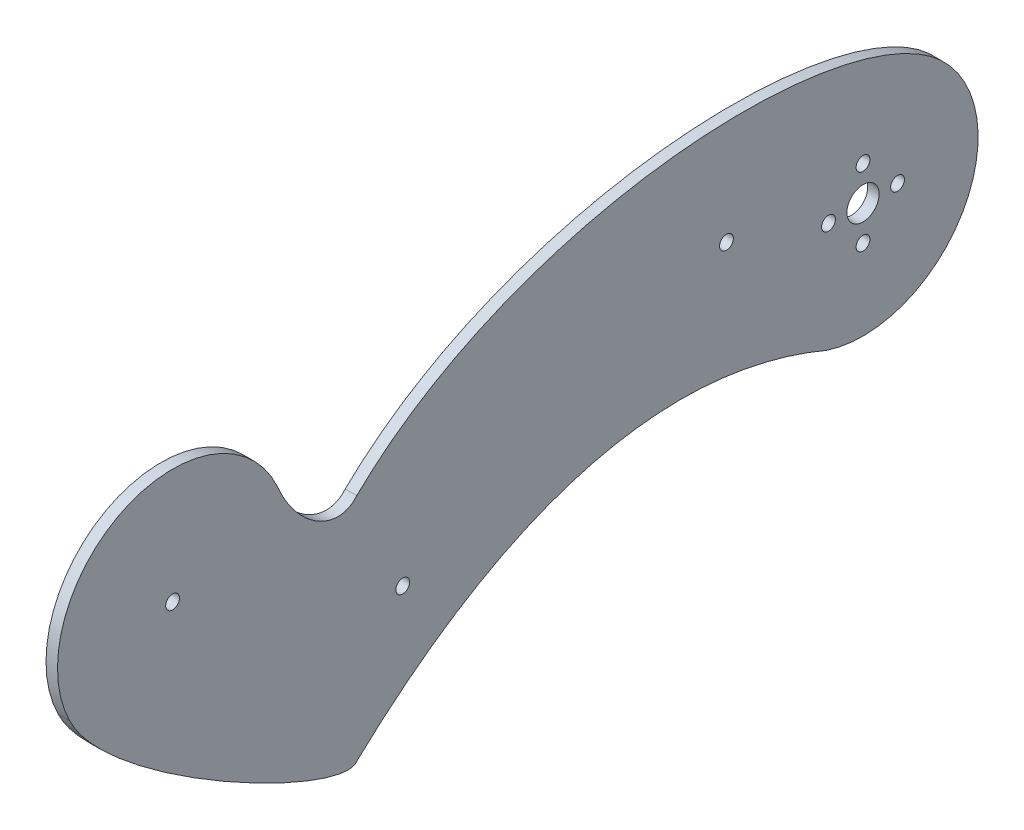
ISO-10303-21;
HEADER;
FILE_DESCRIPTION(('STEP AP214'),'2;1');
FILE_NAME('part.step','',(''),(''),'','','');
FILE_SCHEMA(('AUTOMOTIVE_DESIGN { 1 0 10303 214 1 1 1 1 }'));
ENDSEC;
DATA;
#1=APPLICATION_CONTEXT('core data for automotive mechanical design processes');
#2=APPLICATION_PROTOCOL_DEFINITION('international standard','automotive_design',2000,#1);
#3=PRODUCT_CONTEXT('',#1,'mechanical');
#4=PRODUCT('Part','Part','',(#3));
#5=PRODUCT_RELATED_PRODUCT_CATEGORY('part','',(#4));
#6=PRODUCT_DEFINITION_FORMATION('','',#4);
#7=PRODUCT_DEFINITION_CONTEXT('part definition',#1,'design');
#8=PRODUCT_DEFINITION('design','',#6,#7);
#9=PRODUCT_DEFINITION_SHAPE('','',#8);
#10=(LENGTH_UNIT() NAMED_UNIT(*) SI_UNIT(.MILLI.,.METRE.));
#11=(NAMED_UNIT(*) PLANE_ANGLE_UNIT() SI_UNIT($,.RADIAN.));
#12=(NAMED_UNIT(*) SI_UNIT($,.STERADIAN.) SOLID_ANGLE_UNIT());
#13=UNCERTAINTY_MEASURE_WITH_UNIT(LENGTH_MEASURE(1.E-05),#10,'distance_accuracy_value','');
#14=(GEOMETRIC_REPRESENTATION_CONTEXT(3) GLOBAL_UNCERTAINTY_ASSIGNED_CONTEXT((#13)) GLOBAL_UNIT_ASSIGNED_CONTEXT((#10,
#11,#12)) REPRESENTATION_CONTEXT('',''));
#15=CARTESIAN_POINT('',(0.,0.,0.));
#16=DIRECTION('',(0.,0.,1.));
#17=DIRECTION('',(1.,0.,0.));
#18=AXIS2_PLACEMENT_3D('',#15,#16,#17);
#19=CARTESIAN_POINT('',(2.5,-0.537578350679366,118.512850109838));
#20=DIRECTION('',(1.,0.,0.));
#21=DIRECTION('',(0.,0.,-1.));
#22=AXIS2_PLACEMENT_3D('',#19,#20,#21);
#23=PLANE('',#22);
#24=CARTESIAN_POINT('',(2.5,7.5,0.));
#25=DIRECTION('',(1.,0.,0.));
#26=DIRECTION('',(0.,0.,-1.));
#27=AXIS2_PLACEMENT_3D('',#24,#25,#26);
#28=CIRCLE('',#27,1.5);
#29=CARTESIAN_POINT('',(2.5,7.5,-1.5));
#30=VERTEX_POINT('',#29);
#31=EDGE_CURVE('E196',#30,#30,#28,.T.);
#32=ORIENTED_EDGE('',*,*,#31,.F.);
#33=EDGE_LOOP('',(#32));
#34=FACE_BOUND('',#33,.T.);
#35=CARTESIAN_POINT('',(2.5,0.,7.5));
#36=DIRECTION('',(1.,0.,0.));
#37=DIRECTION('',(0.,0.,-1.));
#38=AXIS2_PLACEMENT_3D('',#35,#36,#37);
#39=CIRCLE('',#38,1.5);
#40=CARTESIAN_POINT('',(2.5,0.,6.));
#41=VERTEX_POINT('',#40);
#42=EDGE_CURVE('E184',#41,#41,#39,.T.);
#43=ORIENTED_EDGE('',*,*,#42,.F.);
#44=EDGE_LOOP('',(#43));
#45=FACE_BOUND('',#44,.T.);
#46=CARTESIAN_POINT('',(2.5,0.,150.));
#47=DIRECTION('',(1.,0.,0.));
#48=DIRECTION('',(0.,0.,-1.));
#49=AXIS2_PLACEMENT_3D('',#46,#47,#48);
#50=CIRCLE('',#49,1.5);
#51=CARTESIAN_POINT('',(2.5,0.,148.5));
#52=VERTEX_POINT('',#51);
#53=EDGE_CURVE('E172',#52,#52,#50,.T.);
#54=ORIENTED_EDGE('',*,*,#53,.F.);
#55=EDGE_LOOP('',(#54));
#56=FACE_BOUND('',#55,.T.);
#57=CARTESIAN_POINT('',(2.5,7.5,29.6616189824279));
#58=DIRECTION('',(1.,0.,0.));
#59=DIRECTION('',(0.,0.,-1.));
#60=AXIS2_PLACEMENT_3D('',#57,#58,#59);
#61=CIRCLE('',#60,1.5);
#62=CARTESIAN_POINT('',(2.5,7.5,28.1616189824279));
#63=VERTEX_POINT('',#62);
#64=EDGE_CURVE('E165',#63,#63,#61,.T.);
#65=ORIENTED_EDGE('',*,*,#64,.F.);
#66=EDGE_LOOP('',(#65));
#67=FACE_BOUND('',#66,.T.);
#68=CARTESIAN_POINT('',(2.5,0.,110.));
#69=CARTESIAN_POINT('',(2.5,-4.93961289191976,114.062747324646));
#70=CARTESIAN_POINT('',(2.5,0.0959038930419477,122.908484161002));
#71=CARTESIAN_POINT('',(2.5,10.2305001911985,127.189106421758));
#72=B_SPLINE_CURVE_WITH_KNOTS('',3,(#68,#69,#70,#71),.UNSPECIFIED.,.F.,.F.,(4,4),(0.,1.),.UNSPECIFIED.);
#73=CARTESIAN_POINT('',(2.5,0.,110.));
#74=VERTEX_POINT('',#73);
#75=CARTESIAN_POINT('',(2.5,10.2305001911985,127.189106421758));
#76=VERTEX_POINT('',#75);
#77=EDGE_CURVE('E154',#74,#76,#72,.T.);
#78=ORIENTED_EDGE('',*,*,#77,.T.);
#79=CARTESIAN_POINT('',(2.5,0.,150.));
#80=DIRECTION('',(1.,0.,0.));
#81=DIRECTION('',(0.,0.,-1.));
#82=AXIS2_PLACEMENT_3D('',#79,#80,#81);
#83=CIRCLE('',#82,25.);
#84=CARTESIAN_POINT('',(2.5,-11.2415757916351,172.32995686787));
#85=VERTEX_POINT('',#84);
#86=EDGE_CURVE('E87',#76,#85,#83,.T.);
#87=ORIENTED_EDGE('',*,*,#86,.T.);
#88=CARTESIAN_POINT('',(2.5,-11.2415757916351,172.32995686787));
#89=CARTESIAN_POINT('',(2.5,-28.4001753150621,164.148966011632));
#90=CARTESIAN_POINT('',(2.5,-55.3095299376104,113.363085110717));
#91=CARTESIAN_POINT('',(2.5,-50.,110.));
#92=B_SPLINE_CURVE_WITH_KNOTS('',3,(#88,#89,#90,#91),.UNSPECIFIED.,.F.,.F.,(4,4),(0.,1.),.UNSPECIFIED.);
#93=CARTESIAN_POINT('',(2.5,-50.,110.));
#94=VERTEX_POINT('',#93);
#95=EDGE_CURVE('E100',#85,#94,#92,.T.);
#96=ORIENTED_EDGE('',*,*,#95,.T.);
#97=CARTESIAN_POINT('',(2.5,-50.,110.));
#98=CARTESIAN_POINT('',(2.5,-25.7702871469308,84.3132798394638));
#99=CARTESIAN_POINT('',(2.5,-6.39735453987135,48.9234641999236));
#100=CARTESIAN_POINT('',(2.5,-23.7340536897292,7.85459709043388));
#101=B_SPLINE_CURVE_WITH_KNOTS('',3,(#97,#98,#99,#100),.UNSPECIFIED.,.F.,.F.,(4,4),(0.,1.),.UNSPECIFIED.);
#102=CARTESIAN_POINT('',(2.5,-23.7340536897292,7.85459709043388));
#103=VERTEX_POINT('',#102);
#104=EDGE_CURVE('E94',#94,#103,#101,.T.);
#105=ORIENTED_EDGE('',*,*,#104,.T.);
#106=CARTESIAN_POINT('',(2.5,0.,0.));
#107=DIRECTION('',(1.,0.,0.));
#108=DIRECTION('',(0.,0.,-1.));
#109=AXIS2_PLACEMENT_3D('',#106,#107,#108);
#110=CIRCLE('',#109,25.);
#111=CARTESIAN_POINT('',(2.5,16.5091951193537,-18.7735579076293));
#112=VERTEX_POINT('',#111);
#113=EDGE_CURVE('E98',#103,#112,#110,.T.);
#114=ORIENTED_EDGE('',*,*,#113,.T.);
#115=CARTESIAN_POINT('',(2.5,16.5091951193535,-18.7735579076294));
#116=CARTESIAN_POINT('',(2.5,38.1328025831612,-0.482929836988057));
#117=CARTESIAN_POINT('',(2.5,35.3013147832118,73.6736620939811));
#118=CARTESIAN_POINT('',(2.5,0.,110.));
#119=B_SPLINE_CURVE_WITH_KNOTS('',3,(#115,#116,#117,#118),.UNSPECIFIED.,.F.,.F.,(4,4),(0.,1.),.UNSPECIFIED.);
#120=EDGE_CURVE('E50',#112,#74,#119,.T.);
#121=ORIENTED_EDGE('',*,*,#120,.T.);
#122=EDGE_LOOP('',(#78,#87,#96,#105,#114,#121));
#123=FACE_BOUND('',#122,.T.);
#124=CARTESIAN_POINT('',(2.5,0.,0.));
#125=DIRECTION('',(1.,0.,0.));
#126=DIRECTION('',(0.,0.,-1.));
#127=AXIS2_PLACEMENT_3D('',#124,#125,#126);
#128=CIRCLE('',#127,3.5);
#129=CARTESIAN_POINT('',(2.5,0.,-3.5));
#130=VERTEX_POINT('',#129);
#131=EDGE_CURVE('E166',#130,#130,#128,.T.);
#132=ORIENTED_EDGE('',*,*,#131,.F.);
#133=EDGE_LOOP('',(#132));
#134=FACE_BOUND('',#133,.T.);
#135=CARTESIAN_POINT('',(2.5,-22.,100.));
#136=DIRECTION('',(1.,0.,0.));
#137=DIRECTION('',(0.,0.,-1.));
#138=AXIS2_PLACEMENT_3D('',#135,#136,#137);
#139=CIRCLE('',#138,1.5);
#140=CARTESIAN_POINT('',(2.5,-22.,98.5));
#141=VERTEX_POINT('',#140);
#142=EDGE_CURVE('E178',#141,#141,#139,.T.);
#143=ORIENTED_EDGE('',*,*,#142,.F.);
#144=EDGE_LOOP('',(#143));
#145=FACE_BOUND('',#144,.T.);
#146=CARTESIAN_POINT('',(2.5,-7.5,0.));
#147=DIRECTION('',(1.,0.,0.));
#148=DIRECTION('',(0.,0.,-1.));
#149=AXIS2_PLACEMENT_3D('',#146,#147,#148);
#150=CIRCLE('',#149,1.5);
#151=CARTESIAN_POINT('',(2.5,-7.5,-1.5));
#152=VERTEX_POINT('',#151);
#153=EDGE_CURVE('E190',#152,#152,#150,.T.);
#154=ORIENTED_EDGE('',*,*,#153,.F.);
#155=EDGE_LOOP('',(#154));
#156=FACE_BOUND('',#155,.T.);
#157=CARTESIAN_POINT('',(2.5,0.,-7.5));
#158=DIRECTION('',(1.,0.,0.));
#159=DIRECTION('',(0.,0.,-1.));
#160=AXIS2_PLACEMENT_3D('',#157,#158,#159);
#161=CIRCLE('',#160,1.5);
#162=CARTESIAN_POINT('',(2.5,0.,-9.));
#163=VERTEX_POINT('',#162);
#164=EDGE_CURVE('E202',#163,#163,#161,.T.);
#165=ORIENTED_EDGE('',*,*,#164,.F.);
#166=EDGE_LOOP('',(#165));
#167=FACE_BOUND('',#166,.T.);
#168=ADVANCED_FACE('F32',(#34,#45,#56,#67,#123,#134,#145,#156,#167),#23,.T.);
#169=CARTESIAN_POINT('',(0.,-0.537578350679366,118.512850109838));
#170=DIRECTION('',(1.,0.,0.));
#171=DIRECTION('',(0.,0.,-1.));
#172=AXIS2_PLACEMENT_3D('',#169,#170,#171);
#173=PLANE('',#172);
#174=CARTESIAN_POINT('',(0.,7.5,0.));
#175=DIRECTION('',(1.,0.,0.));
#176=DIRECTION('',(0.,0.,-1.));
#177=AXIS2_PLACEMENT_3D('',#174,#175,#176);
#178=CIRCLE('',#177,1.5);
#179=CARTESIAN_POINT('',(0.,7.5,-1.5));
#180=VERTEX_POINT('',#179);
#181=EDGE_CURVE('E199',#180,#180,#178,.T.);
#182=ORIENTED_EDGE('',*,*,#181,.T.);
#183=EDGE_LOOP('',(#182));
#184=FACE_BOUND('',#183,.T.);
#185=CARTESIAN_POINT('',(0.,0.,7.5));
#186=DIRECTION('',(1.,0.,0.));
#187=DIRECTION('',(0.,0.,-1.));
#188=AXIS2_PLACEMENT_3D('',#185,#186,#187);
#189=CIRCLE('',#188,1.5);
#190=CARTESIAN_POINT('',(0.,0.,6.));
#191=VERTEX_POINT('',#190);
#192=EDGE_CURVE('E187',#191,#191,#189,.T.);
#193=ORIENTED_EDGE('',*,*,#192,.T.);
#194=EDGE_LOOP('',(#193));
#195=FACE_BOUND('',#194,.T.);
#196=CARTESIAN_POINT('',(0.,0.,150.));
#197=DIRECTION('',(1.,0.,0.));
#198=DIRECTION('',(0.,0.,-1.));
#199=AXIS2_PLACEMENT_3D('',#196,#197,#198);
#200=CIRCLE('',#199,1.5);
#201=CARTESIAN_POINT('',(0.,0.,148.5));
#202=VERTEX_POINT('',#201);
#203=EDGE_CURVE('E175',#202,#202,#200,.T.);
#204=ORIENTED_EDGE('',*,*,#203,.T.);
#205=EDGE_LOOP('',(#204));
#206=FACE_BOUND('',#205,.T.);
#207=CARTESIAN_POINT('',(0.,7.5,29.6616189824279));
#208=DIRECTION('',(1.,0.,0.));
#209=DIRECTION('',(0.,0.,-1.));
#210=AXIS2_PLACEMENT_3D('',#207,#208,#209);
#211=CIRCLE('',#210,1.5);
#212=CARTESIAN_POINT('',(0.,7.5,28.1616189824279));
#213=VERTEX_POINT('',#212);
#214=EDGE_CURVE('E159',#213,#213,#211,.T.);
#215=ORIENTED_EDGE('',*,*,#214,.T.);
#216=EDGE_LOOP('',(#215));
#217=FACE_BOUND('',#216,.T.);
#218=CARTESIAN_POINT('',(0.,0.,110.));
#219=CARTESIAN_POINT('',(0.,-4.93961289191976,114.062747324646));
#220=CARTESIAN_POINT('',(0.,0.0959038930419477,122.908484161002));
#221=CARTESIAN_POINT('',(0.,10.2305001911985,127.189106421758));
#222=B_SPLINE_CURVE_WITH_KNOTS('',3,(#218,#219,#220,#221),.UNSPECIFIED.,.F.,.F.,(4,4),(0.,1.),.UNSPECIFIED.);
#223=CARTESIAN_POINT('',(0.,0.,110.));
#224=VERTEX_POINT('',#223);
#225=CARTESIAN_POINT('',(0.,10.2305001911985,127.189106421758));
#226=VERTEX_POINT('',#225);
#227=EDGE_CURVE('E124',#224,#226,#222,.T.);
#228=ORIENTED_EDGE('',*,*,#227,.F.);
#229=CARTESIAN_POINT('',(0.,16.5091951193535,-18.7735579076294));
#230=CARTESIAN_POINT('',(0.,38.1328025831612,-0.482929836988057));
#231=CARTESIAN_POINT('',(0.,35.3013147832118,73.6736620939811));
#232=CARTESIAN_POINT('',(0.,0.,110.));
#233=B_SPLINE_CURVE_WITH_KNOTS('',3,(#229,#230,#231,#232),.UNSPECIFIED.,.F.,.F.,(4,4),(0.,1.),.UNSPECIFIED.);
#234=CARTESIAN_POINT('',(0.,16.5091951193537,-18.7735579076293));
#235=VERTEX_POINT('',#234);
#236=EDGE_CURVE('E79',#235,#224,#233,.T.);
#237=ORIENTED_EDGE('',*,*,#236,.F.);
#238=CARTESIAN_POINT('',(0.,0.,0.));
#239=DIRECTION('',(1.,0.,0.));
#240=DIRECTION('',(0.,0.,-1.));
#241=AXIS2_PLACEMENT_3D('',#238,#239,#240);
#242=CIRCLE('',#241,25.);
#243=CARTESIAN_POINT('',(0.,-23.7340536897292,7.85459709043388));
#244=VERTEX_POINT('',#243);
#245=EDGE_CURVE('E73',#244,#235,#242,.T.);
#246=ORIENTED_EDGE('',*,*,#245,.F.);
#247=CARTESIAN_POINT('',(0.,-50.,110.));
#248=CARTESIAN_POINT('',(0.,-25.7702871469308,84.3132798394638));
#249=CARTESIAN_POINT('',(0.,-6.39735453987135,48.9234641999236));
#250=CARTESIAN_POINT('',(0.,-23.7340536897292,7.85459709043388));
#251=B_SPLINE_CURVE_WITH_KNOTS('',3,(#247,#248,#249,#250),.UNSPECIFIED.,.F.,.F.,(4,4),(0.,1.),.UNSPECIFIED.);
#252=CARTESIAN_POINT('',(0.,-50.,110.));
#253=VERTEX_POINT('',#252);
#254=EDGE_CURVE('E108',#253,#244,#251,.T.);
#255=ORIENTED_EDGE('',*,*,#254,.F.);
#256=CARTESIAN_POINT('',(0.,-11.2415757916351,172.32995686787));
#257=CARTESIAN_POINT('',(0.,-28.4001753150621,164.148966011632));
#258=CARTESIAN_POINT('',(0.,-55.3095299376104,113.363085110717));
#259=CARTESIAN_POINT('',(0.,-50.,110.));
#260=B_SPLINE_CURVE_WITH_KNOTS('',3,(#256,#257,#258,#259),.UNSPECIFIED.,.F.,.F.,(4,4),(0.,1.),.UNSPECIFIED.);
#261=CARTESIAN_POINT('',(0.,-11.2415757916351,172.32995686787));
#262=VERTEX_POINT('',#261);
#263=EDGE_CURVE('E354',#262,#253,#260,.T.);
#264=ORIENTED_EDGE('',*,*,#263,.F.);
#265=CARTESIAN_POINT('',(0.,0.,150.));
#266=DIRECTION('',(1.,0.,0.));
#267=DIRECTION('',(0.,0.,-1.));
#268=AXIS2_PLACEMENT_3D('',#265,#266,#267);
#269=CIRCLE('',#268,25.);
#270=EDGE_CURVE('E353',#226,#262,#269,.T.);
#271=ORIENTED_EDGE('',*,*,#270,.F.);
#272=EDGE_LOOP('',(#228,#237,#246,#255,#264,#271));
#273=FACE_BOUND('',#272,.T.);
#274=CARTESIAN_POINT('',(0.,0.,0.));
#275=DIRECTION('',(1.,0.,0.));
#276=DIRECTION('',(0.,0.,-1.));
#277=AXIS2_PLACEMENT_3D('',#274,#275,#276);
#278=CIRCLE('',#277,3.5);
#279=CARTESIAN_POINT('',(0.,0.,-3.5));
#280=VERTEX_POINT('',#279);
#281=EDGE_CURVE('E169',#280,#280,#278,.T.);
#282=ORIENTED_EDGE('',*,*,#281,.T.);
#283=EDGE_LOOP('',(#282));
#284=FACE_BOUND('',#283,.T.);
#285=CARTESIAN_POINT('',(0.,-22.,100.));
#286=DIRECTION('',(1.,0.,0.));
#287=DIRECTION('',(0.,0.,-1.));
#288=AXIS2_PLACEMENT_3D('',#285,#286,#287);
#289=CIRCLE('',#288,1.5);
#290=CARTESIAN_POINT('',(0.,-22.,98.5));
#291=VERTEX_POINT('',#290);
#292=EDGE_CURVE('E181',#291,#291,#289,.T.);
#293=ORIENTED_EDGE('',*,*,#292,.T.);
#294=EDGE_LOOP('',(#293));
#295=FACE_BOUND('',#294,.T.);
#296=CARTESIAN_POINT('',(0.,-7.5,0.));
#297=DIRECTION('',(1.,0.,0.));
#298=DIRECTION('',(0.,0.,-1.));
#299=AXIS2_PLACEMENT_3D('',#296,#297,#298);
#300=CIRCLE('',#299,1.5);
#301=CARTESIAN_POINT('',(0.,-7.5,-1.5));
#302=VERTEX_POINT('',#301);
#303=EDGE_CURVE('E193',#302,#302,#300,.T.);
#304=ORIENTED_EDGE('',*,*,#303,.T.);
#305=EDGE_LOOP('',(#304));
#306=FACE_BOUND('',#305,.T.);
#307=CARTESIAN_POINT('',(0.,0.,-7.5));
#308=DIRECTION('',(1.,0.,0.));
#309=DIRECTION('',(0.,0.,-1.));
#310=AXIS2_PLACEMENT_3D('',#307,#308,#309);
#311=CIRCLE('',#310,1.5);
#312=CARTESIAN_POINT('',(0.,0.,-9.));
#313=VERTEX_POINT('',#312);
#314=EDGE_CURVE('E205',#313,#313,#311,.T.);
#315=ORIENTED_EDGE('',*,*,#314,.T.);
#316=EDGE_LOOP('',(#315));
#317=FACE_BOUND('',#316,.T.);
#318=ADVANCED_FACE('F137',(#184,#195,#206,#217,#273,#284,#295,#306,#317),#173,.F.);
#319=DIRECTION('',(-1.,0.,0.));
#320=VECTOR('',#319,1.);
#321=SURFACE_OF_LINEAR_EXTRUSION('',#72,#320);
#322=ORIENTED_EDGE('',*,*,#227,.T.);
#323=DIRECTION('',(-1.,0.,0.));
#324=VECTOR('',#323,1.);
#325=CARTESIAN_POINT('',(2.5,10.2305001911985,127.189106421758));
#326=LINE('',#325,#324);
#327=EDGE_CURVE('E11',#76,#226,#326,.T.);
#328=ORIENTED_EDGE('',*,*,#327,.F.);
#329=ORIENTED_EDGE('',*,*,#77,.F.);
#330=DIRECTION('',(-1.,0.,0.));
#331=VECTOR('',#330,1.);
#332=CARTESIAN_POINT('',(2.5,0.,110.));
#333=LINE('',#332,#331);
#334=EDGE_CURVE('E114',#74,#224,#333,.T.);
#335=ORIENTED_EDGE('',*,*,#334,.T.);
#336=EDGE_LOOP('',(#322,#328,#329,#335));
#337=FACE_BOUND('',#336,.T.);
#338=ADVANCED_FACE('F34',(#337),#321,.F.);
#339=CARTESIAN_POINT('',(2.5,0.,150.));
#340=DIRECTION('',(-1.,0.,0.));
#341=DIRECTION('',(0.,0.,1.));
#342=AXIS2_PLACEMENT_3D('',#339,#340,#341);
#343=CYLINDRICAL_SURFACE('',#342,25.);
#344=ORIENTED_EDGE('',*,*,#270,.T.);
#345=DIRECTION('',(-1.,0.,0.));
#346=VECTOR('',#345,1.);
#347=CARTESIAN_POINT('',(2.5,-11.2415757916351,172.32995686787));
#348=LINE('',#347,#346);
#349=EDGE_CURVE('E42',#85,#262,#348,.T.);
#350=ORIENTED_EDGE('',*,*,#349,.F.);
#351=ORIENTED_EDGE('',*,*,#86,.F.);
#352=ORIENTED_EDGE('',*,*,#327,.T.);
#353=EDGE_LOOP('',(#344,#350,#351,#352));
#354=FACE_BOUND('',#353,.T.);
#355=ADVANCED_FACE('F145',(#354),#343,.T.);
#356=DIRECTION('',(-1.,0.,0.));
#357=VECTOR('',#356,1.);
#358=SURFACE_OF_LINEAR_EXTRUSION('',#92,#357);
#359=ORIENTED_EDGE('',*,*,#263,.T.);
#360=DIRECTION('',(-1.,0.,0.));
#361=VECTOR('',#360,1.);
#362=CARTESIAN_POINT('',(2.5,-50.,110.));
#363=LINE('',#362,#361);
#364=EDGE_CURVE('E109',#94,#253,#363,.T.);
#365=ORIENTED_EDGE('',*,*,#364,.F.);
#366=ORIENTED_EDGE('',*,*,#95,.F.);
#367=ORIENTED_EDGE('',*,*,#349,.T.);
#368=EDGE_LOOP('',(#359,#365,#366,#367));
#369=FACE_BOUND('',#368,.T.);
#370=ADVANCED_FACE('F143',(#369),#358,.F.);
#371=DIRECTION('',(-1.,0.,0.));
#372=VECTOR('',#371,1.);
#373=SURFACE_OF_LINEAR_EXTRUSION('',#101,#372);
#374=ORIENTED_EDGE('',*,*,#254,.T.);
#375=DIRECTION('',(-1.,0.,0.));
#376=VECTOR('',#375,1.);
#377=CARTESIAN_POINT('',(2.5,-23.7340536897292,7.85459709043388));
#378=LINE('',#377,#376);
#379=EDGE_CURVE('E105',#103,#244,#378,.T.);
#380=ORIENTED_EDGE('',*,*,#379,.F.);
#381=ORIENTED_EDGE('',*,*,#104,.F.);
#382=ORIENTED_EDGE('',*,*,#364,.T.);
#383=EDGE_LOOP('',(#374,#380,#381,#382));
#384=FACE_BOUND('',#383,.T.);
#385=ADVANCED_FACE('F106',(#384),#373,.F.);
#386=CARTESIAN_POINT('',(2.5,0.,0.));
#387=DIRECTION('',(-1.,0.,0.));
#388=DIRECTION('',(0.,0.,1.));
#389=AXIS2_PLACEMENT_3D('',#386,#387,#388);
#390=CYLINDRICAL_SURFACE('',#389,25.);
#391=ORIENTED_EDGE('',*,*,#245,.T.);
#392=DIRECTION('',(-1.,0.,0.));
#393=VECTOR('',#392,1.);
#394=CARTESIAN_POINT('',(2.5,16.5091951193537,-18.7735579076293));
#395=LINE('',#394,#393);
#396=EDGE_CURVE('E110',#112,#235,#395,.T.);
#397=ORIENTED_EDGE('',*,*,#396,.F.);
#398=ORIENTED_EDGE('',*,*,#113,.F.);
#399=ORIENTED_EDGE('',*,*,#379,.T.);
#400=EDGE_LOOP('',(#391,#397,#398,#399));
#401=FACE_BOUND('',#400,.T.);
#402=ADVANCED_FACE('F112',(#401),#390,.T.);
#403=DIRECTION('',(-1.,0.,0.));
#404=VECTOR('',#403,1.);
#405=SURFACE_OF_LINEAR_EXTRUSION('',#119,#404);
#406=ORIENTED_EDGE('',*,*,#236,.T.);
#407=ORIENTED_EDGE('',*,*,#334,.F.);
#408=ORIENTED_EDGE('',*,*,#120,.F.);
#409=ORIENTED_EDGE('',*,*,#396,.T.);
#410=EDGE_LOOP('',(#406,#407,#408,#409));
#411=FACE_BOUND('',#410,.T.);
#412=ADVANCED_FACE('F132',(#411),#405,.F.);
#413=CARTESIAN_POINT('',(2.5,7.5,29.6616189824279));
#414=DIRECTION('',(-1.,0.,0.));
#415=DIRECTION('',(0.,0.,1.));
#416=AXIS2_PLACEMENT_3D('',#413,#414,#415);
#417=CYLINDRICAL_SURFACE('',#416,1.5);
#418=ORIENTED_EDGE('',*,*,#64,.T.);
#419=EDGE_LOOP('',(#418));
#420=FACE_BOUND('',#419,.T.);
#421=ORIENTED_EDGE('',*,*,#214,.F.);
#422=EDGE_LOOP('',(#421));
#423=FACE_BOUND('',#422,.T.);
#424=ADVANCED_FACE('F136',(#420,#423),#417,.F.);
#425=CARTESIAN_POINT('',(2.5,0.,0.));
#426=DIRECTION('',(-1.,0.,0.));
#427=DIRECTION('',(0.,0.,1.));
#428=AXIS2_PLACEMENT_3D('',#425,#426,#427);
#429=CYLINDRICAL_SURFACE('',#428,3.5);
#430=ORIENTED_EDGE('',*,*,#131,.T.);
#431=EDGE_LOOP('',(#430));
#432=FACE_BOUND('',#431,.T.);
#433=ORIENTED_EDGE('',*,*,#281,.F.);
#434=EDGE_LOOP('',(#433));
#435=FACE_BOUND('',#434,.T.);
#436=ADVANCED_FACE('F225',(#432,#435),#429,.F.);
#437=CARTESIAN_POINT('',(2.5,0.,150.));
#438=DIRECTION('',(-1.,0.,0.));
#439=DIRECTION('',(0.,0.,1.));
#440=AXIS2_PLACEMENT_3D('',#437,#438,#439);
#441=CYLINDRICAL_SURFACE('',#440,1.5);
#442=ORIENTED_EDGE('',*,*,#53,.T.);
#443=EDGE_LOOP('',(#442));
#444=FACE_BOUND('',#443,.T.);
#445=ORIENTED_EDGE('',*,*,#203,.F.);
#446=EDGE_LOOP('',(#445));
#447=FACE_BOUND('',#446,.T.);
#448=ADVANCED_FACE('F229',(#444,#447),#441,.F.);
#449=CARTESIAN_POINT('',(2.5,-22.,100.));
#450=DIRECTION('',(-1.,0.,0.));
#451=DIRECTION('',(0.,0.,1.));
#452=AXIS2_PLACEMENT_3D('',#449,#450,#451);
#453=CYLINDRICAL_SURFACE('',#452,1.5);
#454=ORIENTED_EDGE('',*,*,#142,.T.);
#455=EDGE_LOOP('',(#454));
#456=FACE_BOUND('',#455,.T.);
#457=ORIENTED_EDGE('',*,*,#292,.F.);
#458=EDGE_LOOP('',(#457));
#459=FACE_BOUND('',#458,.T.);
#460=ADVANCED_FACE('F233',(#456,#459),#453,.F.);
#461=CARTESIAN_POINT('',(2.5,0.,7.5));
#462=DIRECTION('',(-1.,0.,0.));
#463=DIRECTION('',(0.,0.,1.));
#464=AXIS2_PLACEMENT_3D('',#461,#462,#463);
#465=CYLINDRICAL_SURFACE('',#464,1.5);
#466=ORIENTED_EDGE('',*,*,#42,.T.);
#467=EDGE_LOOP('',(#466));
#468=FACE_BOUND('',#467,.T.);
#469=ORIENTED_EDGE('',*,*,#192,.F.);
#470=EDGE_LOOP('',(#469));
#471=FACE_BOUND('',#470,.T.);
#472=ADVANCED_FACE('F237',(#468,#471),#465,.F.);
#473=CARTESIAN_POINT('',(2.5,-7.5,0.));
#474=DIRECTION('',(-1.,0.,0.));
#475=DIRECTION('',(0.,0.,1.));
#476=AXIS2_PLACEMENT_3D('',#473,#474,#475);
#477=CYLINDRICAL_SURFACE('',#476,1.5);
#478=ORIENTED_EDGE('',*,*,#153,.T.);
#479=EDGE_LOOP('',(#478));
#480=FACE_BOUND('',#479,.T.);
#481=ORIENTED_EDGE('',*,*,#303,.F.);
#482=EDGE_LOOP('',(#481));
#483=FACE_BOUND('',#482,.T.);
#484=ADVANCED_FACE('F241',(#480,#483),#477,.F.);
#485=CARTESIAN_POINT('',(2.5,7.5,0.));
#486=DIRECTION('',(-1.,0.,0.));
#487=DIRECTION('',(0.,0.,1.));
#488=AXIS2_PLACEMENT_3D('',#485,#486,#487);
#489=CYLINDRICAL_SURFACE('',#488,1.5);
#490=ORIENTED_EDGE('',*,*,#31,.T.);
#491=EDGE_LOOP('',(#490));
#492=FACE_BOUND('',#491,.T.);
#493=ORIENTED_EDGE('',*,*,#181,.F.);
#494=EDGE_LOOP('',(#493));
#495=FACE_BOUND('',#494,.T.);
#496=ADVANCED_FACE('F245',(#492,#495),#489,.F.);
#497=CARTESIAN_POINT('',(2.5,0.,-7.5));
#498=DIRECTION('',(-1.,0.,0.));
#499=DIRECTION('',(0.,0.,1.));
#500=AXIS2_PLACEMENT_3D('',#497,#498,#499);
#501=CYLINDRICAL_SURFACE('',#500,1.5);
#502=ORIENTED_EDGE('',*,*,#164,.T.);
#503=EDGE_LOOP('',(#502));
#504=FACE_BOUND('',#503,.T.);
#505=ORIENTED_EDGE('',*,*,#314,.F.);
#506=EDGE_LOOP('',(#505));
#507=FACE_BOUND('',#506,.T.);
#508=ADVANCED_FACE('F211',(#504,#507),#501,.F.);
#509=CLOSED_SHELL('',(#168,#318,#338,#355,#370,#385,#402,#412,#424,#436,#448,#460,#472,#484,
#496,#508));
#510=MANIFOLD_SOLID_BREP('B2',#509);
#511=ADVANCED_BREP_SHAPE_REPRESENTATION('',(#18,#510),#14);
#512=SHAPE_DEFINITION_REPRESENTATION(#9,#511);
ENDSEC;
END-ISO-10303-21;
